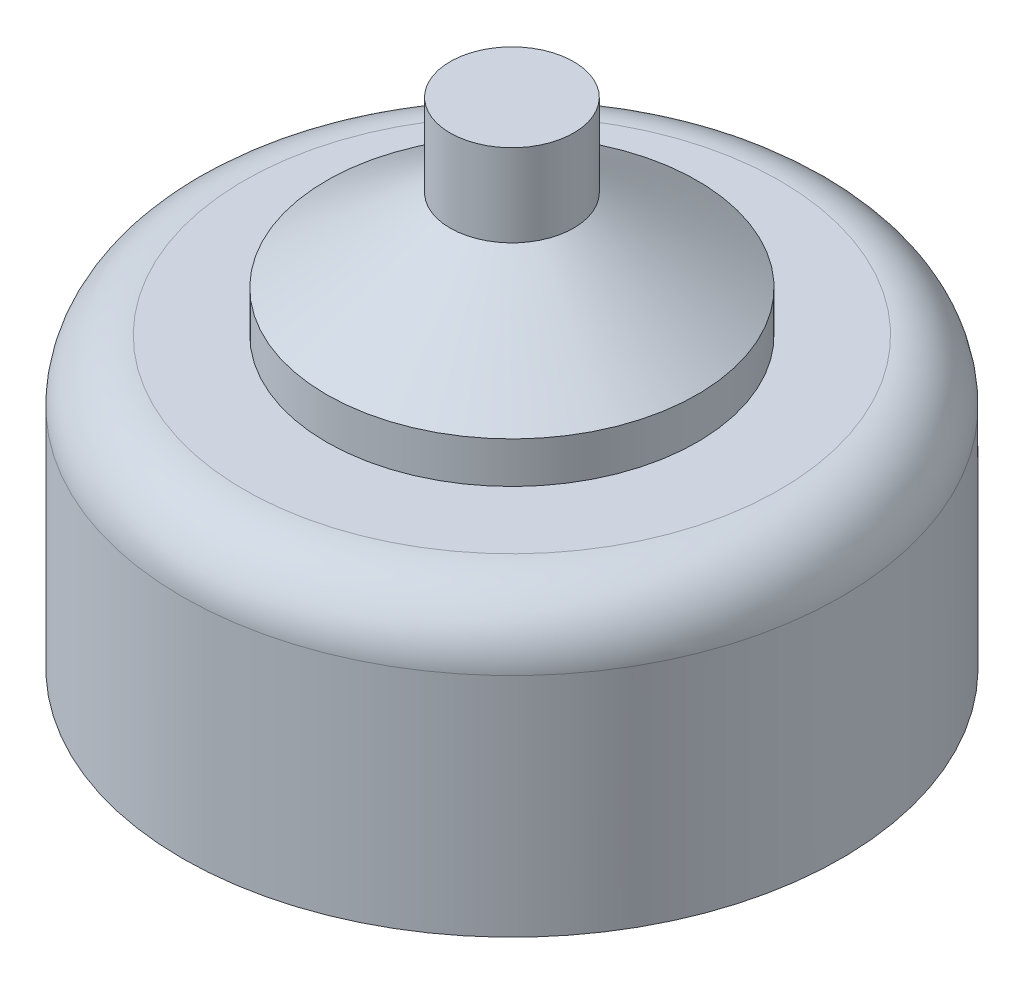
ISO-10303-21;
HEADER;
FILE_DESCRIPTION(('STEP AP214'),'2;1');
FILE_NAME('part.step','',(''),(''),'','','');
FILE_SCHEMA(('AUTOMOTIVE_DESIGN { 1 0 10303 214 1 1 1 1 }'));
ENDSEC;
DATA;
#1=APPLICATION_CONTEXT('core data for automotive mechanical design processes');
#2=APPLICATION_PROTOCOL_DEFINITION('international standard','automotive_design',2000,#1);
#3=PRODUCT_CONTEXT('',#1,'mechanical');
#4=PRODUCT('Part','Part','',(#3));
#5=PRODUCT_RELATED_PRODUCT_CATEGORY('part','',(#4));
#6=PRODUCT_DEFINITION_FORMATION('','',#4);
#7=PRODUCT_DEFINITION_CONTEXT('part definition',#1,'design');
#8=PRODUCT_DEFINITION('design','',#6,#7);
#9=PRODUCT_DEFINITION_SHAPE('','',#8);
#10=(LENGTH_UNIT() NAMED_UNIT(*) SI_UNIT(.MILLI.,.METRE.));
#11=(NAMED_UNIT(*) PLANE_ANGLE_UNIT() SI_UNIT($,.RADIAN.));
#12=(NAMED_UNIT(*) SI_UNIT($,.STERADIAN.) SOLID_ANGLE_UNIT());
#13=UNCERTAINTY_MEASURE_WITH_UNIT(LENGTH_MEASURE(1.E-05),#10,'distance_accuracy_value','');
#14=(GEOMETRIC_REPRESENTATION_CONTEXT(3) GLOBAL_UNCERTAINTY_ASSIGNED_CONTEXT((#13)) GLOBAL_UNIT_ASSIGNED_CONTEXT((#10,
#11,#12)) REPRESENTATION_CONTEXT('',''));
#15=CARTESIAN_POINT('',(0.,0.,0.));
#16=DIRECTION('',(0.,0.,1.));
#17=DIRECTION('',(1.,0.,0.));
#18=AXIS2_PLACEMENT_3D('',#15,#16,#17);
#19=CARTESIAN_POINT('',(0.,-30.0150074313569,0.));
#20=DIRECTION('',(0.,1.,0.));
#21=DIRECTION('',(0.,0.,1.));
#22=AXIS2_PLACEMENT_3D('',#19,#20,#21);
#23=PLANE('',#22);
#24=CARTESIAN_POINT('',(0.,-30.0150074313569,0.));
#25=DIRECTION('',(0.,-1.,0.));
#26=DIRECTION('',(0.,0.,-1.));
#27=AXIS2_PLACEMENT_3D('',#24,#25,#26);
#28=CIRCLE('',#27,2.);
#29=CARTESIAN_POINT('',(0.,-30.0150074313569,-2.));
#30=VERTEX_POINT('',#29);
#31=EDGE_CURVE('E10',#30,#30,#28,.T.);
#32=ORIENTED_EDGE('',*,*,#31,.F.);
#33=EDGE_LOOP('',(#32));
#34=FACE_BOUND('',#33,.T.);
#35=CARTESIAN_POINT('',(0.,-30.0150074313569,0.));
#36=DIRECTION('',(0.,1.,0.));
#37=DIRECTION('',(0.,0.,1.));
#38=AXIS2_PLACEMENT_3D('',#35,#36,#37);
#39=CIRCLE('',#38,8.00000000000003);
#40=CARTESIAN_POINT('',(0.,-30.0150074313569,8.00000000000003));
#41=VERTEX_POINT('',#40);
#42=EDGE_CURVE('E58',#41,#41,#39,.T.);
#43=ORIENTED_EDGE('',*,*,#42,.F.);
#44=EDGE_LOOP('',(#43));
#45=FACE_BOUND('',#44,.T.);
#46=ADVANCED_FACE('F30',(#34,#45),#23,.F.);
#47=CARTESIAN_POINT('',(0.,46.0762167811797,0.));
#48=DIRECTION('',(0.,1.,0.));
#49=DIRECTION('',(0.,0.,1.));
#50=AXIS2_PLACEMENT_3D('',#47,#48,#49);
#51=CYLINDRICAL_SURFACE('',#50,8.00000000000003);
#52=CARTESIAN_POINT('',(0.,-24.5150074313569,0.));
#53=DIRECTION('',(0.,-1.,0.));
#54=DIRECTION('',(0.,0.,-1.));
#55=AXIS2_PLACEMENT_3D('',#52,#53,#54);
#56=CIRCLE('',#55,8.00000000000003);
#57=CARTESIAN_POINT('',(0.,-24.5150074313569,-8.00000000000003));
#58=VERTEX_POINT('',#57);
#59=EDGE_CURVE('E34',#58,#58,#56,.T.);
#60=ORIENTED_EDGE('',*,*,#59,.T.);
#61=EDGE_LOOP('',(#60));
#62=FACE_BOUND('',#61,.T.);
#63=ORIENTED_EDGE('',*,*,#42,.T.);
#64=EDGE_LOOP('',(#63));
#65=FACE_BOUND('',#64,.T.);
#66=ADVANCED_FACE('F82',(#62,#65),#51,.T.);
#67=CARTESIAN_POINT('',(8.00000000000003,-23.0150074313569,0.));
#68=DIRECTION('',(0.,-1.,0.));
#69=DIRECTION('',(0.,0.,-1.));
#70=AXIS2_PLACEMENT_3D('',#67,#68,#69);
#71=PLANE('',#70);
#72=CARTESIAN_POINT('',(0.,-23.0150074313569,0.));
#73=DIRECTION('',(0.,-1.,0.));
#74=DIRECTION('',(0.,0.,-1.));
#75=AXIS2_PLACEMENT_3D('',#72,#73,#74);
#76=CIRCLE('',#75,6.50000000000003);
#77=CARTESIAN_POINT('',(0.,-23.0150074313569,-6.50000000000003));
#78=VERTEX_POINT('',#77);
#79=EDGE_CURVE('E42',#78,#78,#76,.F.);
#80=ORIENTED_EDGE('',*,*,#79,.T.);
#81=EDGE_LOOP('',(#80));
#82=FACE_BOUND('',#81,.T.);
#83=CARTESIAN_POINT('',(0.,-23.0150074313569,0.));
#84=DIRECTION('',(0.,1.,0.));
#85=DIRECTION('',(0.,0.,1.));
#86=AXIS2_PLACEMENT_3D('',#83,#84,#85);
#87=CIRCLE('',#86,4.50000000000003);
#88=CARTESIAN_POINT('',(0.,-23.0150074313569,4.50000000000003));
#89=VERTEX_POINT('',#88);
#90=EDGE_CURVE('E55',#89,#89,#87,.T.);
#91=ORIENTED_EDGE('',*,*,#90,.F.);
#92=EDGE_LOOP('',(#91));
#93=FACE_BOUND('',#92,.T.);
#94=ADVANCED_FACE('F63',(#82,#93),#71,.F.);
#95=CARTESIAN_POINT('',(0.,46.0762167811797,0.));
#96=DIRECTION('',(0.,1.,0.));
#97=DIRECTION('',(0.,0.,1.));
#98=AXIS2_PLACEMENT_3D('',#95,#96,#97);
#99=CYLINDRICAL_SURFACE('',#98,4.50000000000003);
#100=CARTESIAN_POINT('',(0.,-22.0150074313569,0.));
#101=DIRECTION('',(0.,1.,0.));
#102=DIRECTION('',(0.,0.,1.));
#103=AXIS2_PLACEMENT_3D('',#100,#101,#102);
#104=CIRCLE('',#103,4.50000000000003);
#105=CARTESIAN_POINT('',(0.,-22.0150074313569,4.50000000000003));
#106=VERTEX_POINT('',#105);
#107=EDGE_CURVE('E52',#106,#106,#104,.T.);
#108=ORIENTED_EDGE('',*,*,#107,.F.);
#109=EDGE_LOOP('',(#108));
#110=FACE_BOUND('',#109,.T.);
#111=ORIENTED_EDGE('',*,*,#90,.T.);
#112=EDGE_LOOP('',(#111));
#113=FACE_BOUND('',#112,.T.);
#114=ADVANCED_FACE('F93',(#110,#113),#99,.T.);
#115=CARTESIAN_POINT('',(0.,-22.0150074313569,0.));
#116=DIRECTION('',(0.,-1.,0.));
#117=DIRECTION('',(0.,0.,-1.));
#118=AXIS2_PLACEMENT_3D('',#115,#116,#117);
#119=CONICAL_SURFACE('',#118,4.50000000000003,0.982793723247335);
#120=CARTESIAN_POINT('',(0.,-20.0150074313569,0.));
#121=DIRECTION('',(0.,1.,0.));
#122=DIRECTION('',(0.,0.,1.));
#123=AXIS2_PLACEMENT_3D('',#120,#121,#122);
#124=CIRCLE('',#123,1.50000000000001);
#125=CARTESIAN_POINT('',(0.,-20.0150074313569,1.50000000000001));
#126=VERTEX_POINT('',#125);
#127=EDGE_CURVE('E49',#126,#126,#124,.T.);
#128=ORIENTED_EDGE('',*,*,#127,.F.);
#129=EDGE_LOOP('',(#128));
#130=FACE_BOUND('',#129,.T.);
#131=ORIENTED_EDGE('',*,*,#107,.T.);
#132=EDGE_LOOP('',(#131));
#133=FACE_BOUND('',#132,.T.);
#134=ADVANCED_FACE('F96',(#130,#133),#119,.T.);
#135=CARTESIAN_POINT('',(0.,46.0762167811797,0.));
#136=DIRECTION('',(0.,1.,0.));
#137=DIRECTION('',(0.,0.,1.));
#138=AXIS2_PLACEMENT_3D('',#135,#136,#137);
#139=CYLINDRICAL_SURFACE('',#138,1.50000000000001);
#140=CARTESIAN_POINT('',(0.,-18.0150074313569,0.));
#141=DIRECTION('',(0.,1.,0.));
#142=DIRECTION('',(0.,0.,1.));
#143=AXIS2_PLACEMENT_3D('',#140,#141,#142);
#144=CIRCLE('',#143,1.50000000000001);
#145=CARTESIAN_POINT('',(0.,-18.0150074313569,1.50000000000001));
#146=VERTEX_POINT('',#145);
#147=EDGE_CURVE('E46',#146,#146,#144,.T.);
#148=ORIENTED_EDGE('',*,*,#147,.F.);
#149=EDGE_LOOP('',(#148));
#150=FACE_BOUND('',#149,.T.);
#151=ORIENTED_EDGE('',*,*,#127,.T.);
#152=EDGE_LOOP('',(#151));
#153=FACE_BOUND('',#152,.T.);
#154=ADVANCED_FACE('F77',(#150,#153),#139,.T.);
#155=CARTESIAN_POINT('',(1.50000000000001,-18.0150074313569,0.));
#156=DIRECTION('',(0.,-1.,0.));
#157=DIRECTION('',(0.,0.,-1.));
#158=AXIS2_PLACEMENT_3D('',#155,#156,#157);
#159=PLANE('',#158);
#160=ORIENTED_EDGE('',*,*,#147,.T.);
#161=EDGE_LOOP('',(#160));
#162=FACE_BOUND('',#161,.T.);
#163=ADVANCED_FACE('F68',(#162),#159,.F.);
#164=CARTESIAN_POINT('',(0.,-24.5150074313569,0.));
#165=DIRECTION('',(0.,-1.,0.));
#166=DIRECTION('',(0.,0.,-1.));
#167=AXIS2_PLACEMENT_3D('',#164,#165,#166);
#168=TOROIDAL_SURFACE('',#167,6.50000000000003,1.5);
#169=ORIENTED_EDGE('',*,*,#59,.F.);
#170=EDGE_LOOP('',(#169));
#171=FACE_BOUND('',#170,.T.);
#172=ORIENTED_EDGE('',*,*,#79,.F.);
#173=EDGE_LOOP('',(#172));
#174=FACE_BOUND('',#173,.T.);
#175=ADVANCED_FACE('F32',(#171,#174),#168,.T.);
#176=CARTESIAN_POINT('',(0.,-33.0150074313569,0.));
#177=DIRECTION('',(0.,1.,0.));
#178=DIRECTION('',(0.,0.,1.));
#179=AXIS2_PLACEMENT_3D('',#176,#177,#178);
#180=CYLINDRICAL_SURFACE('',#179,2.);
#181=CARTESIAN_POINT('',(0.,-33.0150074313569,0.));
#182=DIRECTION('',(0.,-1.,0.));
#183=DIRECTION('',(0.,0.,-1.));
#184=AXIS2_PLACEMENT_3D('',#181,#182,#183);
#185=CIRCLE('',#184,2.);
#186=CARTESIAN_POINT('',(0.,-33.0150074313569,-2.));
#187=VERTEX_POINT('',#186);
#188=EDGE_CURVE('E45',#187,#187,#185,.T.);
#189=ORIENTED_EDGE('',*,*,#188,.F.);
#190=EDGE_LOOP('',(#189));
#191=FACE_BOUND('',#190,.T.);
#192=ORIENTED_EDGE('',*,*,#31,.T.);
#193=EDGE_LOOP('',(#192));
#194=FACE_BOUND('',#193,.T.);
#195=ADVANCED_FACE('F67',(#191,#194),#180,.T.);
#196=CARTESIAN_POINT('',(0.,-33.0150074313569,0.));
#197=DIRECTION('',(0.,-1.,0.));
#198=DIRECTION('',(0.,0.,-1.));
#199=AXIS2_PLACEMENT_3D('',#196,#197,#198);
#200=PLANE('',#199);
#201=ORIENTED_EDGE('',*,*,#188,.T.);
#202=EDGE_LOOP('',(#201));
#203=FACE_BOUND('',#202,.T.);
#204=ADVANCED_FACE('F74',(#203),#200,.T.);
#205=CLOSED_SHELL('',(#46,#66,#94,#114,#134,#154,#163,#175,#195,#204));
#206=MANIFOLD_SOLID_BREP('B2',#205);
#207=ADVANCED_BREP_SHAPE_REPRESENTATION('',(#18,#206),#14);
#208=SHAPE_DEFINITION_REPRESENTATION(#9,#207);
ENDSEC;
END-ISO-10303-21;
